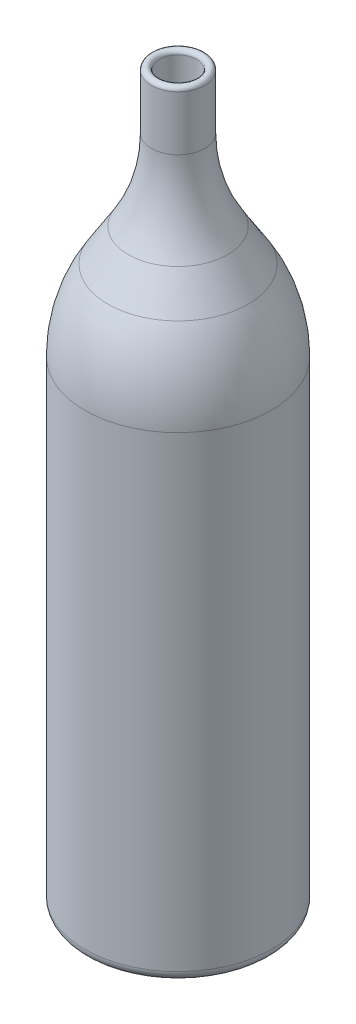
ISO-10303-21;
HEADER;
FILE_DESCRIPTION(('STEP AP214'),'2;1');
FILE_NAME('part.step','',(''),(''),'','','');
FILE_SCHEMA(('AUTOMOTIVE_DESIGN { 1 0 10303 214 1 1 1 1 }'));
ENDSEC;
DATA;
#1=APPLICATION_CONTEXT('core data for automotive mechanical design processes');
#2=APPLICATION_PROTOCOL_DEFINITION('international standard','automotive_design',2000,#1);
#3=PRODUCT_CONTEXT('',#1,'mechanical');
#4=PRODUCT('Part','Part','',(#3));
#5=PRODUCT_RELATED_PRODUCT_CATEGORY('part','',(#4));
#6=PRODUCT_DEFINITION_FORMATION('','',#4);
#7=PRODUCT_DEFINITION_CONTEXT('part definition',#1,'design');
#8=PRODUCT_DEFINITION('design','',#6,#7);
#9=PRODUCT_DEFINITION_SHAPE('','',#8);
#10=(LENGTH_UNIT() NAMED_UNIT(*) SI_UNIT(.MILLI.,.METRE.));
#11=(NAMED_UNIT(*) PLANE_ANGLE_UNIT() SI_UNIT($,.RADIAN.));
#12=(NAMED_UNIT(*) SI_UNIT($,.STERADIAN.) SOLID_ANGLE_UNIT());
#13=UNCERTAINTY_MEASURE_WITH_UNIT(LENGTH_MEASURE(1.E-05),#10,'distance_accuracy_value','');
#14=(GEOMETRIC_REPRESENTATION_CONTEXT(3) GLOBAL_UNCERTAINTY_ASSIGNED_CONTEXT((#13)) GLOBAL_UNIT_ASSIGNED_CONTEXT((#10,
#11,#12)) REPRESENTATION_CONTEXT('',''));
#15=CARTESIAN_POINT('',(0.,0.,0.));
#16=DIRECTION('',(0.,0.,1.));
#17=DIRECTION('',(1.,0.,0.));
#18=AXIS2_PLACEMENT_3D('',#15,#16,#17);
#19=CARTESIAN_POINT('',(0.,272.5,0.));
#20=DIRECTION('',(0.,-1.,0.));
#21=DIRECTION('',(0.,0.,-1.));
#22=AXIS2_PLACEMENT_3D('',#19,#20,#21);
#23=TOROIDAL_SURFACE('',#22,8.5,1.5);
#24=CARTESIAN_POINT('',(0.,272.5,0.));
#25=DIRECTION('',(0.,-1.,0.));
#26=DIRECTION('',(0.,0.,-1.));
#27=AXIS2_PLACEMENT_3D('',#24,#25,#26);
#28=CIRCLE('',#27,10.);
#29=CARTESIAN_POINT('',(0.,272.5,-10.));
#30=VERTEX_POINT('',#29);
#31=EDGE_CURVE('E44',#30,#30,#28,.T.);
#32=ORIENTED_EDGE('',*,*,#31,.F.);
#33=EDGE_LOOP('',(#32));
#34=FACE_BOUND('',#33,.T.);
#35=CARTESIAN_POINT('',(0.,272.5,0.));
#36=DIRECTION('',(0.,-1.,0.));
#37=DIRECTION('',(0.,0.,-1.));
#38=AXIS2_PLACEMENT_3D('',#35,#36,#37);
#39=CIRCLE('',#38,7.);
#40=CARTESIAN_POINT('',(0.,272.5,-7.));
#41=VERTEX_POINT('',#40);
#42=EDGE_CURVE('E10',#41,#41,#39,.F.);
#43=ORIENTED_EDGE('',*,*,#42,.F.);
#44=EDGE_LOOP('',(#43));
#45=FACE_BOUND('',#44,.T.);
#46=ADVANCED_FACE('F37',(#34,#45),#23,.T.);
#47=CARTESIAN_POINT('',(0.,3.5,0.));
#48=DIRECTION('',(0.,-1.,0.));
#49=DIRECTION('',(-1.,0.,0.));
#50=AXIS2_PLACEMENT_3D('',#47,#48,#49);
#51=SPHERICAL_SURFACE('',#50,9.5);
#52=CARTESIAN_POINT('',(0.,11.7794126166855,0.));
#53=DIRECTION('',(0.,-1.,0.));
#54=DIRECTION('',(0.,0.,-1.));
#55=AXIS2_PLACEMENT_3D('',#52,#53,#54);
#56=CIRCLE('',#55,4.65846828074098);
#57=CARTESIAN_POINT('',(0.,11.7794126166855,-4.65846828074098));
#58=VERTEX_POINT('',#57);
#59=EDGE_CURVE('E48',#58,#58,#56,.T.);
#60=ORIENTED_EDGE('',*,*,#59,.T.);
#61=EDGE_LOOP('',(#60));
#62=FACE_BOUND('',#61,.T.);
#63=ADVANCED_FACE('F122',(#62),#51,.F.);
#64=CARTESIAN_POINT('',(0.,1.67027747190412,0.));
#65=DIRECTION('',(0.,-1.,0.));
#66=DIRECTION('',(0.,0.,-1.));
#67=AXIS2_PLACEMENT_3D('',#64,#65,#66);
#68=CONICAL_SURFACE('',#67,22.6252539316176,1.05828771900189);
#69=CARTESIAN_POINT('',(0.,1.67027747190412,0.));
#70=DIRECTION('',(0.,-1.,0.));
#71=DIRECTION('',(0.,0.,-1.));
#72=AXIS2_PLACEMENT_3D('',#69,#70,#71);
#73=CIRCLE('',#72,22.6252539316176);
#74=CARTESIAN_POINT('',(0.,1.67027747190412,-22.6252539316176));
#75=VERTEX_POINT('',#74);
#76=EDGE_CURVE('E52',#75,#75,#73,.T.);
#77=CARTESIAN_POINT('',(0.,11.7794126166855,-4.65846828074098));
#78=CARTESIAN_POINT('',(0.,11.674109125594,-4.84562229793761));
#79=CARTESIAN_POINT('',(0.,11.5688056345025,-5.03277631513424));
#80=CARTESIAN_POINT('',(0.,11.3581986523196,-5.40708434952751));
#81=CARTESIAN_POINT('',(0.,11.2528951612281,-5.59423836672414));
#82=CARTESIAN_POINT('',(0.,11.0422881790451,-5.9685464011174));
#83=CARTESIAN_POINT('',(0.,10.9369846879537,-6.15570041831403));
#84=CARTESIAN_POINT('',(0.,10.7263777057707,-6.5300084527073));
#85=CARTESIAN_POINT('',(0.,10.6210742146793,-6.71716246990393));
#86=CARTESIAN_POINT('',(0.,10.4104672324963,-7.09147050429719));
#87=CARTESIAN_POINT('',(0.,10.3051637414048,-7.27862452149382));
#88=CARTESIAN_POINT('',(0.,10.0945567592219,-7.65293255588708));
#89=CARTESIAN_POINT('',(0.,9.98925326813043,-7.84008657308372));
#90=CARTESIAN_POINT('',(0.,9.77864628594748,-8.21439460747698));
#91=CARTESIAN_POINT('',(0.,9.67334279485601,-8.40154862467361));
#92=CARTESIAN_POINT('',(0.,9.46273581267306,-8.77585665906687));
#93=CARTESIAN_POINT('',(0.,9.35743232158159,-8.9630106762635));
#94=CARTESIAN_POINT('',(0.,9.14682533939865,-9.33731871065677));
#95=CARTESIAN_POINT('',(0.,9.04152184830718,-9.5244727278534));
#96=CARTESIAN_POINT('',(0.,8.83091486612423,-9.89878076224666));
#97=CARTESIAN_POINT('',(0.,8.72561137503276,-10.0859347794433));
#98=CARTESIAN_POINT('',(0.,8.51500439284981,-10.4602428138366));
#99=CARTESIAN_POINT('',(0.,8.40970090175834,-10.6473968310332));
#100=CARTESIAN_POINT('',(0.,8.1990939195754,-11.0217048654265));
#101=CARTESIAN_POINT('',(0.,8.09379042848393,-11.2088588826231));
#102=CARTESIAN_POINT('',(0.,7.88318344630098,-11.5831669170163));
#103=CARTESIAN_POINT('',(0.,7.77787995520951,-11.770320934213));
#104=CARTESIAN_POINT('',(0.,7.56727297302656,-12.1446289686062));
#105=CARTESIAN_POINT('',(0.,7.46196948193509,-12.3317829858029));
#106=CARTESIAN_POINT('',(0.,7.25136249975215,-12.7060910201961));
#107=CARTESIAN_POINT('',(0.,7.14605900866068,-12.8932450373928));
#108=CARTESIAN_POINT('',(0.,6.93545202647773,-13.267553071786));
#109=CARTESIAN_POINT('',(0.,6.83014853538626,-13.4547070889827));
#110=CARTESIAN_POINT('',(0.,6.61954155320331,-13.8290151233759));
#111=CARTESIAN_POINT('',(0.,6.51423806211184,-14.0161691405726));
#112=CARTESIAN_POINT('',(0.,6.3036310799289,-14.3904771749658));
#113=CARTESIAN_POINT('',(0.,6.19832758883743,-14.5776311921624));
#114=CARTESIAN_POINT('',(0.,5.98772060665448,-14.9519392265557));
#115=CARTESIAN_POINT('',(0.,5.88241711556301,-15.1390932437523));
#116=CARTESIAN_POINT('',(0.,5.67181013338007,-15.5134012781456));
#117=CARTESIAN_POINT('',(0.,5.56650664228859,-15.7005552953422));
#118=CARTESIAN_POINT('',(0.,5.35589966010565,-16.0748633297355));
#119=CARTESIAN_POINT('',(0.,5.25059616901418,-16.2620173469321));
#120=CARTESIAN_POINT('',(0.,5.03998918683123,-16.6363253813254));
#121=CARTESIAN_POINT('',(0.,4.93468569573976,-16.823479398522));
#122=CARTESIAN_POINT('',(0.,4.72407871355682,-17.1977874329153));
#123=CARTESIAN_POINT('',(0.,4.61877522246534,-17.3849414501119));
#124=CARTESIAN_POINT('',(0.,4.4081682402824,-17.7592494845052));
#125=CARTESIAN_POINT('',(0.,4.30286474919093,-17.9464035017018));
#126=CARTESIAN_POINT('',(0.,4.09225776700798,-18.3207115360951));
#127=CARTESIAN_POINT('',(0.,3.98695427591651,-18.5078655532917));
#128=CARTESIAN_POINT('',(0.,3.77634729373356,-18.882173587685));
#129=CARTESIAN_POINT('',(0.,3.67104380264209,-19.0693276048816));
#130=CARTESIAN_POINT('',(0.,3.46043682045915,-19.4436356392749));
#131=CARTESIAN_POINT('',(0.,3.35513332936768,-19.6307896564715));
#132=CARTESIAN_POINT('',(0.,3.14452634718473,-20.0050976908648));
#133=CARTESIAN_POINT('',(0.,3.03922285609326,-20.1922517080614));
#134=CARTESIAN_POINT('',(0.,2.82861587391032,-20.5665597424547));
#135=CARTESIAN_POINT('',(0.,2.72331238281884,-20.7537137596513));
#136=CARTESIAN_POINT('',(0.,2.5127054006359,-21.1280217940445));
#137=CARTESIAN_POINT('',(0.,2.40740190954443,-21.3151758112412));
#138=CARTESIAN_POINT('',(0.,2.19679492736148,-21.6894838456344));
#139=CARTESIAN_POINT('',(0.,2.09149143627001,-21.8766378628311));
#140=CARTESIAN_POINT('',(0.,1.88088445408707,-22.2509458972243));
#141=CARTESIAN_POINT('',(0.,1.77558096299559,-22.438099914421));
#142=CARTESIAN_POINT('',(0.,1.67027747190412,-22.6252539316176));
#143=B_SPLINE_CURVE_WITH_KNOTS('',3,(#77,#78,#79,#80,#81,#82,#83,#84,#85,#86,#87,#88,#89,#90,
#91,#92,#93,#94,#95,#96,#97,#98,#99,#100,#101,#102,#103,#104,#105,#106,#107,#108,#109,#110,#111,
#112,#113,#114,#115,#116,#117,#118,#119,#120,#121,#122,#123,#124,#125,#126,#127,#128,#129,#130,
#131,#132,#133,#134,#135,#136,#137,#138,#139,#140,#141,#142),.UNSPECIFIED.,.F.,.F.,(4,2,2,2,2,2,
2,2,2,2,2,2,2,2,2,2,2,2,2,2,2,2,2,2,2,2,2,2,2,2,2,2,4),(0.,0.644235254002759,1.28847050800552,
1.93270576200828,2.57694101601103,3.2211762700138,3.86541152401655,4.50964677801931,
5.15388203202207,5.79811728602483,6.44235254002759,7.08658779403035,7.73082304803311,
8.37505830203586,9.01929355603862,9.66352881004138,10.3077640640441,10.9519993180469,
11.5962345720497,12.2404698260524,12.8847050800552,13.5289403340579,14.1731755880607,
14.8174108420634,15.4616460960662,16.105881350069,16.7501166040717,17.3943518580745,
18.0385871120772,18.68282236608,19.3270576200828,19.9712928740855,20.6155281280883),.UNSPECIFIED.);
#144=EDGE_CURVE('BSEAM127',#58,#75,#143,.T.);
#145=ORIENTED_EDGE('',*,*,#59,.F.);
#146=ORIENTED_EDGE('',*,*,#76,.T.);
#147=ORIENTED_EDGE('',*,*,#144,.T.);
#148=ORIENTED_EDGE('',*,*,#144,.F.);
#149=EDGE_LOOP('',(#145,#147,#146,#148));
#150=FACE_BOUND('',#149,.T.);
#151=ADVANCED_FACE('F127',(#150),#68,.F.);
#152=CARTESIAN_POINT('',(0.,13.,0.));
#153=DIRECTION('',(0.,-1.,0.));
#154=DIRECTION('',(0.,0.,-1.));
#155=AXIS2_PLACEMENT_3D('',#152,#153,#154);
#156=TOROIDAL_SURFACE('',#155,29.,13.);
#157=ORIENTED_EDGE('',*,*,#76,.F.);
#158=EDGE_LOOP('',(#157));
#159=FACE_BOUND('',#158,.T.);
#160=CARTESIAN_POINT('',(0.,0.,0.));
#161=DIRECTION('',(0.,-1.,0.));
#162=DIRECTION('',(0.,0.,-1.));
#163=AXIS2_PLACEMENT_3D('',#160,#161,#162);
#164=CIRCLE('',#163,29.);
#165=CARTESIAN_POINT('',(0.,0.,-29.));
#166=VERTEX_POINT('',#165);
#167=EDGE_CURVE('E57',#166,#166,#164,.T.);
#168=ORIENTED_EDGE('',*,*,#167,.T.);
#169=EDGE_LOOP('',(#168));
#170=FACE_BOUND('',#169,.T.);
#171=ADVANCED_FACE('F133',(#159,#170),#156,.T.);
#172=CARTESIAN_POINT('',(-30.9999999999999,0.,0.));
#173=DIRECTION('',(0.,1.,0.));
#174=DIRECTION('',(0.,0.,1.));
#175=AXIS2_PLACEMENT_3D('',#172,#173,#174);
#176=PLANE('',#175);
#177=ORIENTED_EDGE('',*,*,#167,.F.);
#178=EDGE_LOOP('',(#177));
#179=FACE_BOUND('',#178,.T.);
#180=CARTESIAN_POINT('',(0.,0.,0.));
#181=DIRECTION('',(0.,-1.,0.));
#182=DIRECTION('',(0.,0.,-1.));
#183=AXIS2_PLACEMENT_3D('',#180,#181,#182);
#184=CIRCLE('',#183,30.9999999999999);
#185=CARTESIAN_POINT('',(0.,0.,-30.9999999999999));
#186=VERTEX_POINT('',#185);
#187=EDGE_CURVE('E60',#186,#186,#184,.T.);
#188=ORIENTED_EDGE('',*,*,#187,.T.);
#189=EDGE_LOOP('',(#188));
#190=FACE_BOUND('',#189,.T.);
#191=ADVANCED_FACE('F139',(#179,#190),#176,.F.);
#192=CARTESIAN_POINT('',(0.,4.,0.));
#193=DIRECTION('',(0.,-1.,0.));
#194=DIRECTION('',(0.,0.,-1.));
#195=AXIS2_PLACEMENT_3D('',#192,#193,#194);
#196=TOROIDAL_SURFACE('',#195,31.,4.);
#197=ORIENTED_EDGE('',*,*,#187,.F.);
#198=EDGE_LOOP('',(#197));
#199=FACE_BOUND('',#198,.T.);
#200=CARTESIAN_POINT('',(0.,4.00000000000003,0.));
#201=DIRECTION('',(0.,-1.,0.));
#202=DIRECTION('',(0.,0.,-1.));
#203=AXIS2_PLACEMENT_3D('',#200,#201,#202);
#204=CIRCLE('',#203,35.);
#205=CARTESIAN_POINT('',(0.,4.00000000000003,-35.));
#206=VERTEX_POINT('',#205);
#207=EDGE_CURVE('E63',#206,#206,#204,.T.);
#208=ORIENTED_EDGE('',*,*,#207,.T.);
#209=EDGE_LOOP('',(#208));
#210=FACE_BOUND('',#209,.T.);
#211=ADVANCED_FACE('F143',(#199,#210),#196,.T.);
#212=CARTESIAN_POINT('',(0.,0.,0.));
#213=DIRECTION('',(0.,-1.,0.));
#214=DIRECTION('',(0.,0.,-1.));
#215=AXIS2_PLACEMENT_3D('',#212,#213,#214);
#216=CYLINDRICAL_SURFACE('',#215,35.);
#217=ORIENTED_EDGE('',*,*,#207,.F.);
#218=EDGE_LOOP('',(#217));
#219=FACE_BOUND('',#218,.T.);
#220=CARTESIAN_POINT('',(0.,179.30266279747,0.));
#221=DIRECTION('',(0.,-1.,0.));
#222=DIRECTION('',(0.,0.,-1.));
#223=AXIS2_PLACEMENT_3D('',#220,#221,#222);
#224=CIRCLE('',#223,35.);
#225=CARTESIAN_POINT('',(0.,179.30266279747,-35.));
#226=VERTEX_POINT('',#225);
#227=EDGE_CURVE('E66',#226,#226,#224,.T.);
#228=ORIENTED_EDGE('',*,*,#227,.T.);
#229=EDGE_LOOP('',(#228));
#230=FACE_BOUND('',#229,.T.);
#231=ADVANCED_FACE('F147',(#219,#230),#216,.T.);
#232=CARTESIAN_POINT('',(0.,179.30266279747,0.));
#233=DIRECTION('',(0.,-1.,0.));
#234=DIRECTION('',(0.,0.,-1.));
#235=AXIS2_PLACEMENT_3D('',#232,#233,#234);
#236=DEGENERATE_TOROIDAL_SURFACE('',#235,22.,57.,.F.);
#237=ORIENTED_EDGE('',*,*,#227,.F.);
#238=EDGE_LOOP('',(#237));
#239=FACE_BOUND('',#238,.T.);
#240=CARTESIAN_POINT('',(0.,209.508060858762,0.));
#241=DIRECTION('',(0.,-1.,0.));
#242=DIRECTION('',(0.,0.,-1.));
#243=AXIS2_PLACEMENT_3D('',#240,#241,#242);
#244=CIRCLE('',#243,26.3387414809162);
#245=CARTESIAN_POINT('',(0.,209.508060858762,-26.3387414809162));
#246=VERTEX_POINT('',#245);
#247=EDGE_CURVE('E69',#246,#246,#244,.T.);
#248=ORIENTED_EDGE('',*,*,#247,.T.);
#249=EDGE_LOOP('',(#248));
#250=FACE_BOUND('',#249,.T.);
#251=ADVANCED_FACE('F151',(#239,#250),#236,.F.);
#252=CARTESIAN_POINT('',(0.,221.794601938707,0.));
#253=DIRECTION('',(0.,-1.,0.));
#254=DIRECTION('',(0.,0.,-1.));
#255=AXIS2_PLACEMENT_3D('',#252,#253,#254);
#256=CONICAL_SURFACE('',#255,18.6612585190837,0.558505360638185);
#257=ORIENTED_EDGE('',*,*,#247,.F.);
#258=EDGE_LOOP('',(#257));
#259=FACE_BOUND('',#258,.T.);
#260=CARTESIAN_POINT('',(0.,221.794601938707,0.));
#261=DIRECTION('',(0.,-1.,0.));
#262=DIRECTION('',(0.,0.,-1.));
#263=AXIS2_PLACEMENT_3D('',#260,#261,#262);
#264=CIRCLE('',#263,18.6612585190837);
#265=CARTESIAN_POINT('',(0.,221.794601938707,-18.6612585190837));
#266=VERTEX_POINT('',#265);
#267=EDGE_CURVE('E72',#266,#266,#264,.T.);
#268=ORIENTED_EDGE('',*,*,#267,.T.);
#269=EDGE_LOOP('',(#268));
#270=FACE_BOUND('',#269,.T.);
#271=ADVANCED_FACE('F155',(#259,#270),#256,.T.);
#272=CARTESIAN_POINT('',(0.,252.,0.));
#273=DIRECTION('',(0.,-1.,0.));
#274=DIRECTION('',(0.,0.,-1.));
#275=AXIS2_PLACEMENT_3D('',#272,#273,#274);
#276=TOROIDAL_SURFACE('',#275,67.,57.);
#277=ORIENTED_EDGE('',*,*,#267,.F.);
#278=EDGE_LOOP('',(#277));
#279=FACE_BOUND('',#278,.T.);
#280=CARTESIAN_POINT('',(0.,252.,0.));
#281=DIRECTION('',(0.,-1.,0.));
#282=DIRECTION('',(0.,0.,-1.));
#283=AXIS2_PLACEMENT_3D('',#280,#281,#282);
#284=CIRCLE('',#283,10.);
#285=CARTESIAN_POINT('',(0.,252.,-10.));
#286=VERTEX_POINT('',#285);
#287=EDGE_CURVE('E75',#286,#286,#284,.T.);
#288=ORIENTED_EDGE('',*,*,#287,.T.);
#289=EDGE_LOOP('',(#288));
#290=FACE_BOUND('',#289,.T.);
#291=ADVANCED_FACE('F119',(#279,#290),#276,.F.);
#292=CARTESIAN_POINT('',(0.,0.,0.));
#293=DIRECTION('',(0.,-1.,0.));
#294=DIRECTION('',(0.,0.,-1.));
#295=AXIS2_PLACEMENT_3D('',#292,#293,#294);
#296=CYLINDRICAL_SURFACE('',#295,10.);
#297=ORIENTED_EDGE('',*,*,#31,.T.);
#298=EDGE_LOOP('',(#297));
#299=FACE_BOUND('',#298,.T.);
#300=ORIENTED_EDGE('',*,*,#287,.F.);
#301=EDGE_LOOP('',(#300));
#302=FACE_BOUND('',#301,.T.);
#303=ADVANCED_FACE('F111',(#299,#302),#296,.T.);
#304=CARTESIAN_POINT('',(0.,3.5,0.));
#305=DIRECTION('',(0.,-1.,0.));
#306=DIRECTION('',(-1.,0.,0.));
#307=AXIS2_PLACEMENT_3D('',#304,#305,#306);
#308=SPHERICAL_SURFACE('',#307,12.5);
#309=CARTESIAN_POINT('',(0.,14.393963969323,0.));
#310=DIRECTION('',(0.,-1.,0.));
#311=DIRECTION('',(0.,0.,-1.));
#312=AXIS2_PLACEMENT_3D('',#309,#310,#311);
#313=CIRCLE('',#312,6.12956352729076);
#314=CARTESIAN_POINT('',(0.,14.393963969323,-6.12956352729077));
#315=VERTEX_POINT('',#314);
#316=EDGE_CURVE('E78',#315,#315,#313,.T.);
#317=ORIENTED_EDGE('',*,*,#316,.F.);
#318=EDGE_LOOP('',(#317));
#319=FACE_BOUND('',#318,.T.);
#320=ADVANCED_FACE('F109',(#319),#308,.T.);
#321=CARTESIAN_POINT('',(0.,4.28482882454163,0.));
#322=DIRECTION('',(0.,-1.,0.));
#323=DIRECTION('',(0.,0.,-1.));
#324=AXIS2_PLACEMENT_3D('',#321,#322,#323);
#325=CONICAL_SURFACE('',#324,24.0963491781674,1.05828771900189);
#326=CARTESIAN_POINT('',(0.,4.28482882454163,0.));
#327=DIRECTION('',(0.,-1.,0.));
#328=DIRECTION('',(0.,0.,-1.));
#329=AXIS2_PLACEMENT_3D('',#326,#327,#328);
#330=CIRCLE('',#329,24.0963491781674);
#331=CARTESIAN_POINT('',(0.,4.28482882454163,-24.0963491781674));
#332=VERTEX_POINT('',#331);
#333=EDGE_CURVE('E100',#332,#332,#330,.T.);
#334=CARTESIAN_POINT('',(0.,14.393963969323,-6.12956352729077));
#335=CARTESIAN_POINT('',(0.,14.2886604782315,-6.3167175444874));
#336=CARTESIAN_POINT('',(0.,14.18335698714,-6.50387156168403));
#337=CARTESIAN_POINT('',(0.,13.9727500049571,-6.8781795960773));
#338=CARTESIAN_POINT('',(0.,13.8674465138656,-7.06533361327393));
#339=CARTESIAN_POINT('',(0.,13.6568395316827,-7.43964164766719));
#340=CARTESIAN_POINT('',(0.,13.5515360405912,-7.62679566486382));
#341=CARTESIAN_POINT('',(0.,13.3409290584082,-8.00110369925708));
#342=CARTESIAN_POINT('',(0.,13.2356255673168,-8.18825771645372));
#343=CARTESIAN_POINT('',(0.,13.0250185851338,-8.56256575084698));
#344=CARTESIAN_POINT('',(0.,12.9197150940423,-8.74971976804361));
#345=CARTESIAN_POINT('',(0.,12.7091081118594,-9.12402780243687));
#346=CARTESIAN_POINT('',(0.,12.6038046207679,-9.3111818196335));
#347=CARTESIAN_POINT('',(0.,12.393197638585,-9.68548985402677));
#348=CARTESIAN_POINT('',(0.,12.2878941474935,-9.8726438712234));
#349=CARTESIAN_POINT('',(0.,12.0772871653106,-10.2469519056167));
#350=CARTESIAN_POINT('',(0.,11.9719836742191,-10.4341059228133));
#351=CARTESIAN_POINT('',(0.,11.7613766920362,-10.8084139572066));
#352=CARTESIAN_POINT('',(0.,11.6560732009447,-10.9955679744032));
#353=CARTESIAN_POINT('',(0.,11.4454662187617,-11.3698760087964));
#354=CARTESIAN_POINT('',(0.,11.3401627276703,-11.5570300259931));
#355=CARTESIAN_POINT('',(0.,11.1295557454873,-11.9313380603863));
#356=CARTESIAN_POINT('',(0.,11.0242522543959,-12.118492077583));
#357=CARTESIAN_POINT('',(0.,10.8136452722129,-12.4928001119762));
#358=CARTESIAN_POINT('',(0.,10.7083417811214,-12.6799541291729));
#359=CARTESIAN_POINT('',(0.,10.4977347989385,-13.0542621635661));
#360=CARTESIAN_POINT('',(0.,10.392431307847,-13.2414161807628));
#361=CARTESIAN_POINT('',(0.,10.1818243256641,-13.615724215156));
#362=CARTESIAN_POINT('',(0.,10.0765208345726,-13.8028782323527));
#363=CARTESIAN_POINT('',(0.,9.86591385238966,-14.1771862667459));
#364=CARTESIAN_POINT('',(0.,9.76061036129818,-14.3643402839426));
#365=CARTESIAN_POINT('',(0.,9.55000337911524,-14.7386483183358));
#366=CARTESIAN_POINT('',(0.,9.44469988802377,-14.9258023355324));
#367=CARTESIAN_POINT('',(0.,9.23409290584082,-15.3001103699257));
#368=CARTESIAN_POINT('',(0.,9.12878941474935,-15.4872643871223));
#369=CARTESIAN_POINT('',(0.,8.91818243256641,-15.8615724215156));
#370=CARTESIAN_POINT('',(0.,8.81287894147493,-16.0487264387122));
#371=CARTESIAN_POINT('',(0.,8.60227195929199,-16.4230344731055));
#372=CARTESIAN_POINT('',(0.,8.49696846820052,-16.6101884903021));
#373=CARTESIAN_POINT('',(0.,8.28636148601757,-16.9844965246954));
#374=CARTESIAN_POINT('',(0.,8.1810579949261,-17.171650541892));
#375=CARTESIAN_POINT('',(0.,7.97045101274316,-17.5459585762853));
#376=CARTESIAN_POINT('',(0.,7.86514752165168,-17.7331125934819));
#377=CARTESIAN_POINT('',(0.,7.65454053946874,-18.1074206278752));
#378=CARTESIAN_POINT('',(0.,7.54923704837727,-18.2945746450718));
#379=CARTESIAN_POINT('',(0.,7.33863006619432,-18.6688826794651));
#380=CARTESIAN_POINT('',(0.,7.23332657510285,-18.8560366966617));
#381=CARTESIAN_POINT('',(0.,7.02271959291991,-19.230344731055));
#382=CARTESIAN_POINT('',(0.,6.91741610182844,-19.4174987482516));
#383=CARTESIAN_POINT('',(0.,6.70680911964549,-19.7918067826449));
#384=CARTESIAN_POINT('',(0.,6.60150562855402,-19.9789607998415));
#385=CARTESIAN_POINT('',(0.,6.39089864637108,-20.3532688342348));
#386=CARTESIAN_POINT('',(0.,6.2855951552796,-20.5404228514314));
#387=CARTESIAN_POINT('',(0.,6.07498817309666,-20.9147308858246));
#388=CARTESIAN_POINT('',(0.,5.96968468200519,-21.1018849030213));
#389=CARTESIAN_POINT('',(0.,5.75907769982224,-21.4761929374145));
#390=CARTESIAN_POINT('',(0.,5.65377420873077,-21.6633469546112));
#391=CARTESIAN_POINT('',(0.,5.44316722654783,-22.0376549890044));
#392=CARTESIAN_POINT('',(0.,5.33786373545635,-22.2248090062011));
#393=CARTESIAN_POINT('',(0.,5.12725675327341,-22.5991170405943));
#394=CARTESIAN_POINT('',(0.,5.02195326218194,-22.786271057791));
#395=CARTESIAN_POINT('',(0.,4.81134627999899,-23.1605790921842));
#396=CARTESIAN_POINT('',(0.,4.70604278890752,-23.3477331093809));
#397=CARTESIAN_POINT('',(0.,4.49543580672458,-23.7220411437741));
#398=CARTESIAN_POINT('',(0.,4.3901323156331,-23.9091951609708));
#399=CARTESIAN_POINT('',(0.,4.28482882454163,-24.0963491781674));
#400=B_SPLINE_CURVE_WITH_KNOTS('',3,(#334,#335,#336,#337,#338,#339,#340,#341,#342,#343,#344,
#345,#346,#347,#348,#349,#350,#351,#352,#353,#354,#355,#356,#357,#358,#359,#360,#361,#362,#363,
#364,#365,#366,#367,#368,#369,#370,#371,#372,#373,#374,#375,#376,#377,#378,#379,#380,#381,#382,
#383,#384,#385,#386,#387,#388,#389,#390,#391,#392,#393,#394,#395,#396,#397,#398,#399),
.UNSPECIFIED.,.F.,.F.,(4,2,2,2,2,2,2,2,2,2,2,2,2,2,2,2,2,2,2,2,2,2,2,2,2,2,2,2,2,2,2,2,4),(0.,
0.644235254002759,1.28847050800551,1.93270576200828,2.57694101601103,3.22117627001379,
3.86541152401655,4.50964677801931,5.15388203202207,5.79811728602483,6.44235254002758,
7.08658779403034,7.7308230480331,8.37505830203586,9.01929355603862,9.66352881004138,
10.3077640640441,10.9519993180469,11.5962345720497,12.2404698260524,12.8847050800552,
13.5289403340579,14.1731755880607,14.8174108420634,15.4616460960662,16.105881350069,
16.7501166040717,17.3943518580745,18.0385871120772,18.68282236608,19.3270576200828,
19.9712928740855,20.6155281280883),.UNSPECIFIED.);
#401=EDGE_CURVE('BSEAM106',#315,#332,#400,.T.);
#402=ORIENTED_EDGE('',*,*,#316,.T.);
#403=ORIENTED_EDGE('',*,*,#333,.F.);
#404=ORIENTED_EDGE('',*,*,#401,.T.);
#405=ORIENTED_EDGE('',*,*,#401,.F.);
#406=EDGE_LOOP('',(#402,#404,#403,#405));
#407=FACE_BOUND('',#406,.T.);
#408=ADVANCED_FACE('F106',(#407),#325,.T.);
#409=CARTESIAN_POINT('',(0.,13.,0.));
#410=DIRECTION('',(0.,-1.,0.));
#411=DIRECTION('',(0.,0.,-1.));
#412=AXIS2_PLACEMENT_3D('',#409,#410,#411);
#413=TOROIDAL_SURFACE('',#412,29.,10.);
#414=ORIENTED_EDGE('',*,*,#333,.T.);
#415=EDGE_LOOP('',(#414));
#416=FACE_BOUND('',#415,.T.);
#417=CARTESIAN_POINT('',(0.,3.,0.));
#418=DIRECTION('',(0.,-1.,0.));
#419=DIRECTION('',(0.,0.,-1.));
#420=AXIS2_PLACEMENT_3D('',#417,#418,#419);
#421=CIRCLE('',#420,29.);
#422=CARTESIAN_POINT('',(0.,3.,-29.));
#423=VERTEX_POINT('',#422);
#424=EDGE_CURVE('E97',#423,#423,#421,.T.);
#425=ORIENTED_EDGE('',*,*,#424,.F.);
#426=EDGE_LOOP('',(#425));
#427=FACE_BOUND('',#426,.T.);
#428=ADVANCED_FACE('F117',(#416,#427),#413,.F.);
#429=CARTESIAN_POINT('',(-30.9999999999999,3.,0.));
#430=DIRECTION('',(0.,1.,0.));
#431=DIRECTION('',(0.,0.,1.));
#432=AXIS2_PLACEMENT_3D('',#429,#430,#431);
#433=PLANE('',#432);
#434=ORIENTED_EDGE('',*,*,#424,.T.);
#435=EDGE_LOOP('',(#434));
#436=FACE_BOUND('',#435,.T.);
#437=CARTESIAN_POINT('',(0.,3.,0.));
#438=DIRECTION('',(0.,-1.,0.));
#439=DIRECTION('',(0.,0.,-1.));
#440=AXIS2_PLACEMENT_3D('',#437,#438,#439);
#441=CIRCLE('',#440,31.);
#442=CARTESIAN_POINT('',(0.,3.,-31.));
#443=VERTEX_POINT('',#442);
#444=EDGE_CURVE('E94',#443,#443,#441,.T.);
#445=ORIENTED_EDGE('',*,*,#444,.F.);
#446=EDGE_LOOP('',(#445));
#447=FACE_BOUND('',#446,.T.);
#448=ADVANCED_FACE('F185',(#436,#447),#433,.T.);
#449=CARTESIAN_POINT('',(0.,4.,0.));
#450=DIRECTION('',(0.,-1.,0.));
#451=DIRECTION('',(0.,0.,-1.));
#452=AXIS2_PLACEMENT_3D('',#449,#450,#451);
#453=TOROIDAL_SURFACE('',#452,31.,1.);
#454=ORIENTED_EDGE('',*,*,#444,.T.);
#455=EDGE_LOOP('',(#454));
#456=FACE_BOUND('',#455,.T.);
#457=CARTESIAN_POINT('',(0.,4.00000000000001,0.));
#458=DIRECTION('',(0.,-1.,0.));
#459=DIRECTION('',(0.,0.,-1.));
#460=AXIS2_PLACEMENT_3D('',#457,#458,#459);
#461=CIRCLE('',#460,32.);
#462=CARTESIAN_POINT('',(0.,4.00000000000001,-32.));
#463=VERTEX_POINT('',#462);
#464=EDGE_CURVE('E91',#463,#463,#461,.T.);
#465=ORIENTED_EDGE('',*,*,#464,.F.);
#466=EDGE_LOOP('',(#465));
#467=FACE_BOUND('',#466,.T.);
#468=ADVANCED_FACE('F181',(#456,#467),#453,.F.);
#469=CARTESIAN_POINT('',(0.,0.,0.));
#470=DIRECTION('',(0.,-1.,0.));
#471=DIRECTION('',(0.,0.,-1.));
#472=AXIS2_PLACEMENT_3D('',#469,#470,#471);
#473=CYLINDRICAL_SURFACE('',#472,32.);
#474=ORIENTED_EDGE('',*,*,#464,.T.);
#475=EDGE_LOOP('',(#474));
#476=FACE_BOUND('',#475,.T.);
#477=CARTESIAN_POINT('',(0.,179.30266279747,0.));
#478=DIRECTION('',(0.,-1.,0.));
#479=DIRECTION('',(0.,0.,-1.));
#480=AXIS2_PLACEMENT_3D('',#477,#478,#479);
#481=CIRCLE('',#480,32.);
#482=CARTESIAN_POINT('',(0.,179.30266279747,-32.));
#483=VERTEX_POINT('',#482);
#484=EDGE_CURVE('E88',#483,#483,#481,.T.);
#485=ORIENTED_EDGE('',*,*,#484,.F.);
#486=EDGE_LOOP('',(#485));
#487=FACE_BOUND('',#486,.T.);
#488=ADVANCED_FACE('F177',(#476,#487),#473,.F.);
#489=CARTESIAN_POINT('',(0.,179.30266279747,0.));
#490=DIRECTION('',(0.,-1.,0.));
#491=DIRECTION('',(0.,0.,-1.));
#492=AXIS2_PLACEMENT_3D('',#489,#490,#491);
#493=DEGENERATE_TOROIDAL_SURFACE('',#492,22.,54.,.F.);
#494=ORIENTED_EDGE('',*,*,#484,.T.);
#495=EDGE_LOOP('',(#494));
#496=FACE_BOUND('',#495,.T.);
#497=CARTESIAN_POINT('',(0.,207.918303066063,0.));
#498=DIRECTION('',(0.,-1.,0.));
#499=DIRECTION('',(0.,0.,-1.));
#500=AXIS2_PLACEMENT_3D('',#497,#498,#499);
#501=CIRCLE('',#500,23.794597192447);
#502=CARTESIAN_POINT('',(0.,207.918303066063,-23.794597192447));
#503=VERTEX_POINT('',#502);
#504=EDGE_CURVE('E85',#503,#503,#501,.T.);
#505=ORIENTED_EDGE('',*,*,#504,.F.);
#506=EDGE_LOOP('',(#505));
#507=FACE_BOUND('',#506,.T.);
#508=ADVANCED_FACE('F173',(#496,#507),#493,.T.);
#509=CARTESIAN_POINT('',(0.,220.204844146008,0.));
#510=DIRECTION('',(0.,-1.,0.));
#511=DIRECTION('',(0.,0.,-1.));
#512=AXIS2_PLACEMENT_3D('',#509,#510,#511);
#513=CONICAL_SURFACE('',#512,16.1171142306145,0.558505360638185);
#514=ORIENTED_EDGE('',*,*,#504,.T.);
#515=EDGE_LOOP('',(#514));
#516=FACE_BOUND('',#515,.T.);
#517=CARTESIAN_POINT('',(0.,220.204844146008,0.));
#518=DIRECTION('',(0.,-1.,0.));
#519=DIRECTION('',(0.,0.,-1.));
#520=AXIS2_PLACEMENT_3D('',#517,#518,#519);
#521=CIRCLE('',#520,16.1171142306145);
#522=CARTESIAN_POINT('',(0.,220.204844146008,-16.1171142306145));
#523=VERTEX_POINT('',#522);
#524=EDGE_CURVE('E82',#523,#523,#521,.T.);
#525=ORIENTED_EDGE('',*,*,#524,.F.);
#526=EDGE_LOOP('',(#525));
#527=FACE_BOUND('',#526,.T.);
#528=ADVANCED_FACE('F169',(#516,#527),#513,.F.);
#529=CARTESIAN_POINT('',(0.,252.,0.));
#530=DIRECTION('',(0.,-1.,0.));
#531=DIRECTION('',(0.,0.,-1.));
#532=AXIS2_PLACEMENT_3D('',#529,#530,#531);
#533=TOROIDAL_SURFACE('',#532,67.,60.);
#534=ORIENTED_EDGE('',*,*,#524,.T.);
#535=EDGE_LOOP('',(#534));
#536=FACE_BOUND('',#535,.T.);
#537=CARTESIAN_POINT('',(0.,252.,0.));
#538=DIRECTION('',(0.,-1.,0.));
#539=DIRECTION('',(0.,0.,-1.));
#540=AXIS2_PLACEMENT_3D('',#537,#538,#539);
#541=CIRCLE('',#540,6.99999999999999);
#542=CARTESIAN_POINT('',(0.,252.,-6.99999999999999));
#543=VERTEX_POINT('',#542);
#544=EDGE_CURVE('E79',#543,#543,#541,.T.);
#545=ORIENTED_EDGE('',*,*,#544,.F.);
#546=EDGE_LOOP('',(#545));
#547=FACE_BOUND('',#546,.T.);
#548=ADVANCED_FACE('F166',(#536,#547),#533,.T.);
#549=CARTESIAN_POINT('',(0.,0.,0.));
#550=DIRECTION('',(0.,-1.,0.));
#551=DIRECTION('',(0.,0.,-1.));
#552=AXIS2_PLACEMENT_3D('',#549,#550,#551);
#553=CYLINDRICAL_SURFACE('',#552,7.);
#554=ORIENTED_EDGE('',*,*,#42,.T.);
#555=EDGE_LOOP('',(#554));
#556=FACE_BOUND('',#555,.T.);
#557=ORIENTED_EDGE('',*,*,#544,.T.);
#558=EDGE_LOOP('',(#557));
#559=FACE_BOUND('',#558,.T.);
#560=ADVANCED_FACE('F163',(#556,#559),#553,.F.);
#561=CLOSED_SHELL('',(#46,#63,#151,#171,#191,#211,#231,#251,#271,#291,#303,#320,#408,#428,#448,
#468,#488,#508,#528,#548,#560));
#562=MANIFOLD_SOLID_BREP('B2',#561);
#563=ADVANCED_BREP_SHAPE_REPRESENTATION('',(#18,#562),#14);
#564=SHAPE_DEFINITION_REPRESENTATION(#9,#563);
ENDSEC;
END-ISO-10303-21;
